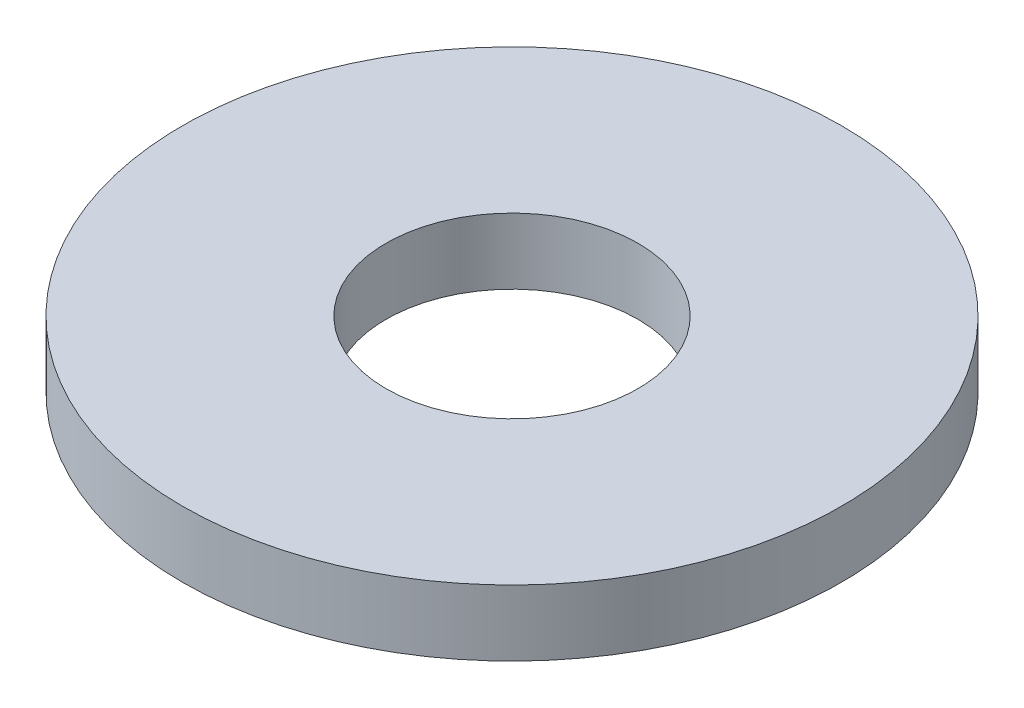
ISO-10303-21;
HEADER;
FILE_DESCRIPTION(('STEP AP214'),'2;1');
FILE_NAME('part.step','',(''),(''),'','','');
FILE_SCHEMA(('AUTOMOTIVE_DESIGN { 1 0 10303 214 1 1 1 1 }'));
ENDSEC;
DATA;
#1=APPLICATION_CONTEXT('core data for automotive mechanical design processes');
#2=APPLICATION_PROTOCOL_DEFINITION('international standard','automotive_design',2000,#1);
#3=PRODUCT_CONTEXT('',#1,'mechanical');
#4=PRODUCT('Part','Part','',(#3));
#5=PRODUCT_RELATED_PRODUCT_CATEGORY('part','',(#4));
#6=PRODUCT_DEFINITION_FORMATION('','',#4);
#7=PRODUCT_DEFINITION_CONTEXT('part definition',#1,'design');
#8=PRODUCT_DEFINITION('design','',#6,#7);
#9=PRODUCT_DEFINITION_SHAPE('','',#8);
#10=(LENGTH_UNIT() NAMED_UNIT(*) SI_UNIT(.MILLI.,.METRE.));
#11=(NAMED_UNIT(*) PLANE_ANGLE_UNIT() SI_UNIT($,.RADIAN.));
#12=(NAMED_UNIT(*) SI_UNIT($,.STERADIAN.) SOLID_ANGLE_UNIT());
#13=UNCERTAINTY_MEASURE_WITH_UNIT(LENGTH_MEASURE(1.E-05),#10,'distance_accuracy_value','');
#14=(GEOMETRIC_REPRESENTATION_CONTEXT(3) GLOBAL_UNCERTAINTY_ASSIGNED_CONTEXT((#13)) GLOBAL_UNIT_ASSIGNED_CONTEXT((#10,
#11,#12)) REPRESENTATION_CONTEXT('',''));
#15=CARTESIAN_POINT('',(0.,0.,0.));
#16=DIRECTION('',(0.,0.,1.));
#17=DIRECTION('',(1.,0.,0.));
#18=AXIS2_PLACEMENT_3D('',#15,#16,#17);
#19=CARTESIAN_POINT('',(0.,17.,0.));
#20=DIRECTION('',(0.,-1.,0.));
#21=DIRECTION('',(0.,0.,-1.));
#22=AXIS2_PLACEMENT_3D('',#19,#20,#21);
#23=CYLINDRICAL_SURFACE('',#22,85.);
#24=CARTESIAN_POINT('',(0.,17.,0.));
#25=DIRECTION('',(0.,1.,0.));
#26=DIRECTION('',(0.,0.,1.));
#27=AXIS2_PLACEMENT_3D('',#24,#25,#26);
#28=CIRCLE('',#27,85.);
#29=CARTESIAN_POINT('',(0.,17.,85.));
#30=VERTEX_POINT('',#29);
#31=EDGE_CURVE('E10',#30,#30,#28,.T.);
#32=ORIENTED_EDGE('',*,*,#31,.F.);
#33=EDGE_LOOP('',(#32));
#34=FACE_BOUND('',#33,.T.);
#35=CARTESIAN_POINT('',(0.,0.,0.));
#36=DIRECTION('',(0.,1.,0.));
#37=DIRECTION('',(0.,0.,1.));
#38=AXIS2_PLACEMENT_3D('',#35,#36,#37);
#39=CIRCLE('',#38,85.);
#40=CARTESIAN_POINT('',(0.,0.,85.));
#41=VERTEX_POINT('',#40);
#42=EDGE_CURVE('E37',#41,#41,#39,.T.);
#43=ORIENTED_EDGE('',*,*,#42,.T.);
#44=EDGE_LOOP('',(#43));
#45=FACE_BOUND('',#44,.T.);
#46=ADVANCED_FACE('F40',(#34,#45),#23,.T.);
#47=CARTESIAN_POINT('',(0.,17.,0.));
#48=DIRECTION('',(0.,1.,0.));
#49=DIRECTION('',(0.,0.,1.));
#50=AXIS2_PLACEMENT_3D('',#47,#48,#49);
#51=PLANE('',#50);
#52=CARTESIAN_POINT('',(0.,17.,0.));
#53=DIRECTION('',(0.,1.,0.));
#54=DIRECTION('',(0.,0.,1.));
#55=AXIS2_PLACEMENT_3D('',#52,#53,#54);
#56=CIRCLE('',#55,32.5);
#57=CARTESIAN_POINT('',(0.,17.,32.5));
#58=VERTEX_POINT('',#57);
#59=EDGE_CURVE('E50',#58,#58,#56,.T.);
#60=ORIENTED_EDGE('',*,*,#59,.F.);
#61=EDGE_LOOP('',(#60));
#62=FACE_BOUND('',#61,.T.);
#63=ORIENTED_EDGE('',*,*,#31,.T.);
#64=EDGE_LOOP('',(#63));
#65=FACE_BOUND('',#64,.T.);
#66=ADVANCED_FACE('F59',(#62,#65),#51,.T.);
#67=CARTESIAN_POINT('',(0.,0.,0.));
#68=DIRECTION('',(0.,1.,0.));
#69=DIRECTION('',(0.,0.,1.));
#70=AXIS2_PLACEMENT_3D('',#67,#68,#69);
#71=PLANE('',#70);
#72=CARTESIAN_POINT('',(0.,0.,0.));
#73=DIRECTION('',(0.,1.,0.));
#74=DIRECTION('',(0.,0.,1.));
#75=AXIS2_PLACEMENT_3D('',#72,#73,#74);
#76=CIRCLE('',#75,32.5);
#77=CARTESIAN_POINT('',(0.,0.,32.5));
#78=VERTEX_POINT('',#77);
#79=EDGE_CURVE('E47',#78,#78,#76,.T.);
#80=ORIENTED_EDGE('',*,*,#79,.T.);
#81=EDGE_LOOP('',(#80));
#82=FACE_BOUND('',#81,.T.);
#83=ORIENTED_EDGE('',*,*,#42,.F.);
#84=EDGE_LOOP('',(#83));
#85=FACE_BOUND('',#84,.T.);
#86=ADVANCED_FACE('F58',(#82,#85),#71,.F.);
#87=CARTESIAN_POINT('',(0.,17.,0.));
#88=DIRECTION('',(0.,-1.,0.));
#89=DIRECTION('',(0.,0.,-1.));
#90=AXIS2_PLACEMENT_3D('',#87,#88,#89);
#91=CYLINDRICAL_SURFACE('',#90,32.5);
#92=ORIENTED_EDGE('',*,*,#59,.T.);
#93=EDGE_LOOP('',(#92));
#94=FACE_BOUND('',#93,.T.);
#95=ORIENTED_EDGE('',*,*,#79,.F.);
#96=EDGE_LOOP('',(#95));
#97=FACE_BOUND('',#96,.T.);
#98=ADVANCED_FACE('F54',(#94,#97),#91,.F.);
#99=CLOSED_SHELL('',(#46,#66,#86,#98));
#100=MANIFOLD_SOLID_BREP('B2',#99);
#101=ADVANCED_BREP_SHAPE_REPRESENTATION('',(#18,#100),#14);
#102=SHAPE_DEFINITION_REPRESENTATION(#9,#101);
ENDSEC;
END-ISO-10303-21;
